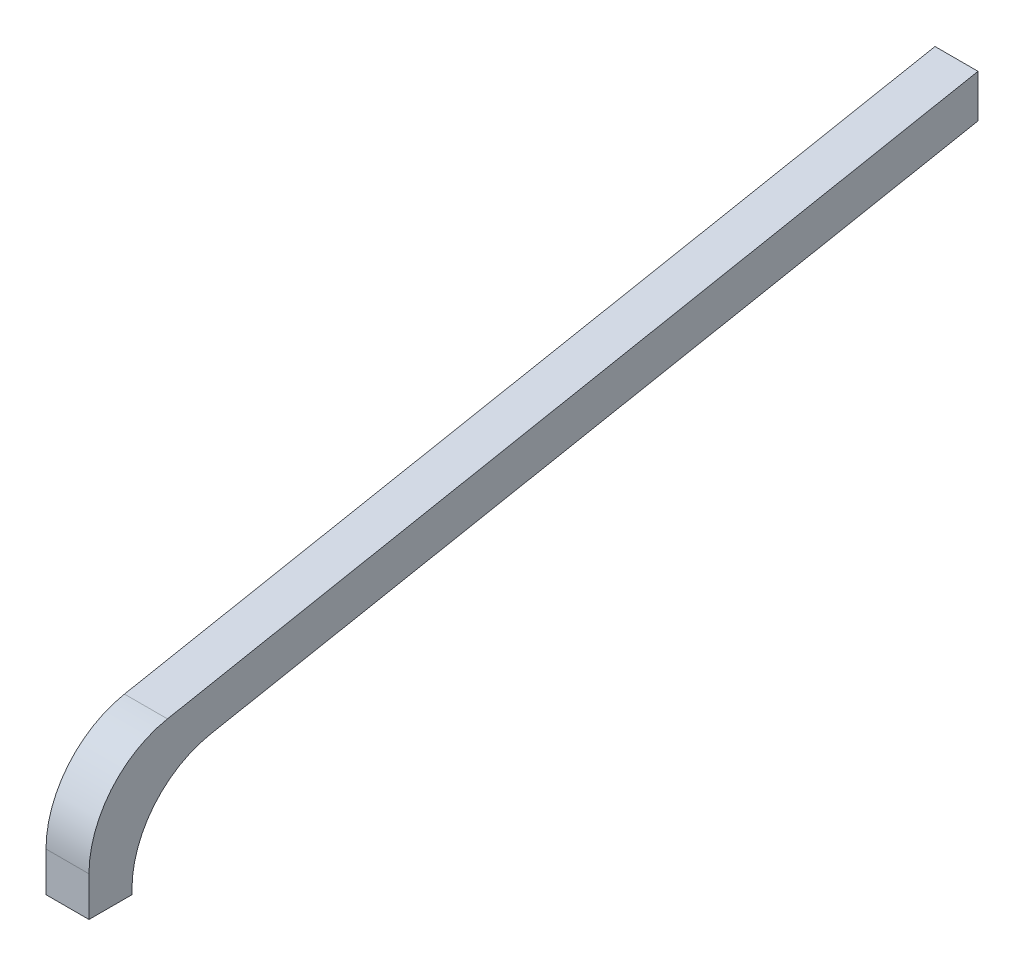
ISO-10303-21;
HEADER;
FILE_DESCRIPTION(('STEP AP214'),'2;1');
FILE_NAME('part.step','',(''),(''),'','','');
FILE_SCHEMA(('AUTOMOTIVE_DESIGN { 1 0 10303 214 1 1 1 1 }'));
ENDSEC;
DATA;
#1=APPLICATION_CONTEXT('core data for automotive mechanical design processes');
#2=APPLICATION_PROTOCOL_DEFINITION('international standard','automotive_design',2000,#1);
#3=PRODUCT_CONTEXT('',#1,'mechanical');
#4=PRODUCT('Part','Part','',(#3));
#5=PRODUCT_RELATED_PRODUCT_CATEGORY('part','',(#4));
#6=PRODUCT_DEFINITION_FORMATION('','',#4);
#7=PRODUCT_DEFINITION_CONTEXT('part definition',#1,'design');
#8=PRODUCT_DEFINITION('design','',#6,#7);
#9=PRODUCT_DEFINITION_SHAPE('','',#8);
#10=(LENGTH_UNIT() NAMED_UNIT(*) SI_UNIT(.MILLI.,.METRE.));
#11=(NAMED_UNIT(*) PLANE_ANGLE_UNIT() SI_UNIT($,.RADIAN.));
#12=(NAMED_UNIT(*) SI_UNIT($,.STERADIAN.) SOLID_ANGLE_UNIT());
#13=UNCERTAINTY_MEASURE_WITH_UNIT(LENGTH_MEASURE(1.E-05),#10,'distance_accuracy_value','');
#14=(GEOMETRIC_REPRESENTATION_CONTEXT(3) GLOBAL_UNCERTAINTY_ASSIGNED_CONTEXT((#13)) GLOBAL_UNIT_ASSIGNED_CONTEXT((#10,
#11,#12)) REPRESENTATION_CONTEXT('',''));
#15=CARTESIAN_POINT('',(0.,0.,0.));
#16=DIRECTION('',(0.,0.,1.));
#17=DIRECTION('',(1.,0.,0.));
#18=AXIS2_PLACEMENT_3D('',#15,#16,#17);
#19=CARTESIAN_POINT('',(1.30175,-3.01580115473571,-2.8055));
#20=DIRECTION('',(1.,0.,0.));
#21=DIRECTION('',(0.,0.,-1.));
#22=AXIS2_PLACEMENT_3D('',#19,#20,#21);
#23=PLANE('',#22);
#24=DIRECTION('',(0.,-0.18846469104419,0.982079966311104));
#25=VECTOR('',#24,1.);
#26=CARTESIAN_POINT('',(1.30175,-2.3929200336889,-3.06153530895581));
#27=LINE('',#26,#25);
#28=CARTESIAN_POINT('',(1.30175,-0.869500000000001,-11.));
#29=VERTEX_POINT('',#28);
#30=CARTESIAN_POINT('',(1.30175,-2.3929200336889,-3.06153530895581));
#31=VERTEX_POINT('',#30);
#32=EDGE_CURVE('E96',#29,#31,#27,.T.);
#33=ORIENTED_EDGE('',*,*,#32,.T.);
#34=CARTESIAN_POINT('',(1.30175,-3.375,-3.25));
#35=DIRECTION('',(-1.,0.,0.));
#36=DIRECTION('',(0.,0.,1.));
#37=AXIS2_PLACEMENT_3D('',#34,#35,#36);
#38=CIRCLE('',#37,1.);
#39=CARTESIAN_POINT('',(1.30175,-3.375,-2.25));
#40=VERTEX_POINT('',#39);
#41=EDGE_CURVE('E119',#31,#40,#38,.F.);
#42=ORIENTED_EDGE('',*,*,#41,.T.);
#43=DIRECTION('',(0.,1.,0.));
#44=VECTOR('',#43,1.);
#45=CARTESIAN_POINT('',(1.30175,-3.425,-2.25));
#46=LINE('',#45,#44);
#47=CARTESIAN_POINT('',(1.30175,-3.425,-2.25));
#48=VERTEX_POINT('',#47);
#49=EDGE_CURVE('E124',#40,#48,#46,.F.);
#50=ORIENTED_EDGE('',*,*,#49,.T.);
#51=DIRECTION('',(0.,0.,1.));
#52=VECTOR('',#51,1.);
#53=CARTESIAN_POINT('',(1.30175,-3.425,-1.8055));
#54=LINE('',#53,#52);
#55=CARTESIAN_POINT('',(1.30175,-3.425,-1.8055));
#56=VERTEX_POINT('',#55);
#57=EDGE_CURVE('E133',#48,#56,#54,.T.);
#58=ORIENTED_EDGE('',*,*,#57,.T.);
#59=DIRECTION('',(0.,1.,0.));
#60=VECTOR('',#59,1.);
#61=CARTESIAN_POINT('',(1.30175,-3.01580115473571,-1.8055));
#62=LINE('',#61,#60);
#63=CARTESIAN_POINT('',(1.30175,-3.01580115473571,-1.8055));
#64=VERTEX_POINT('',#63);
#65=EDGE_CURVE('E141',#56,#64,#62,.T.);
#66=ORIENTED_EDGE('',*,*,#65,.T.);
#67=CARTESIAN_POINT('',(1.30175,-3.01580115473571,-2.8055));
#68=DIRECTION('',(-1.,0.,0.));
#69=DIRECTION('',(0.,0.,1.));
#70=AXIS2_PLACEMENT_3D('',#67,#68,#69);
#71=CIRCLE('',#70,1.);
#72=CARTESIAN_POINT('',(1.30175,-2.03372118842461,-2.61703530895581));
#73=VERTEX_POINT('',#72);
#74=EDGE_CURVE('E20',#73,#64,#71,.F.);
#75=ORIENTED_EDGE('',*,*,#74,.F.);
#76=DIRECTION('',(0.,0.18846469104419,-0.982079966311104));
#77=VECTOR('',#76,1.);
#78=CARTESIAN_POINT('',(1.30175,-0.425000000000001,-11.));
#79=LINE('',#78,#77);
#80=CARTESIAN_POINT('',(1.30175,-0.425000000000001,-11.));
#81=VERTEX_POINT('',#80);
#82=EDGE_CURVE('E150',#73,#81,#79,.T.);
#83=ORIENTED_EDGE('',*,*,#82,.T.);
#84=DIRECTION('',(0.,1.,0.));
#85=VECTOR('',#84,1.);
#86=CARTESIAN_POINT('',(1.30175,-0.869500000000001,-11.));
#87=LINE('',#86,#85);
#88=EDGE_CURVE('E70',#81,#29,#87,.F.);
#89=ORIENTED_EDGE('',*,*,#88,.T.);
#90=EDGE_LOOP('',(#33,#42,#50,#58,#66,#75,#83,#89));
#91=FACE_BOUND('',#90,.T.);
#92=ADVANCED_FACE('F17',(#91),#23,.F.);
#93=CARTESIAN_POINT('',(1.74625,-0.869500000000001,-11.));
#94=DIRECTION('',(0.,0.,1.));
#95=DIRECTION('',(1.,0.,0.));
#96=AXIS2_PLACEMENT_3D('',#93,#94,#95);
#97=PLANE('',#96);
#98=DIRECTION('',(1.,0.,0.));
#99=VECTOR('',#98,1.);
#100=CARTESIAN_POINT('',(1.74625,-0.425000000000001,-11.));
#101=LINE('',#100,#99);
#102=CARTESIAN_POINT('',(1.74625,-0.425000000000001,-11.));
#103=VERTEX_POINT('',#102);
#104=EDGE_CURVE('E91',#81,#103,#101,.T.);
#105=ORIENTED_EDGE('',*,*,#104,.T.);
#106=DIRECTION('',(0.,1.,0.));
#107=VECTOR('',#106,1.);
#108=CARTESIAN_POINT('',(1.74625,-3.01580115473571,-11.));
#109=LINE('',#108,#107);
#110=CARTESIAN_POINT('',(1.74625,-0.869500000000001,-11.));
#111=VERTEX_POINT('',#110);
#112=EDGE_CURVE('E85',#111,#103,#109,.T.);
#113=ORIENTED_EDGE('',*,*,#112,.F.);
#114=DIRECTION('',(1.,0.,0.));
#115=VECTOR('',#114,1.);
#116=CARTESIAN_POINT('',(1.74625,-0.869500000000001,-11.));
#117=LINE('',#116,#115);
#118=EDGE_CURVE('E88',#111,#29,#117,.F.);
#119=ORIENTED_EDGE('',*,*,#118,.T.);
#120=ORIENTED_EDGE('',*,*,#88,.F.);
#121=EDGE_LOOP('',(#105,#113,#119,#120));
#122=FACE_BOUND('',#121,.T.);
#123=ADVANCED_FACE('F87',(#122),#97,.F.);
#124=CARTESIAN_POINT('',(1.74625,-0.425000000000001,-11.));
#125=DIRECTION('',(0.,-0.982079966311104,-0.18846469104419));
#126=DIRECTION('',(0.,0.18846469104419,-0.982079966311104));
#127=AXIS2_PLACEMENT_3D('',#124,#125,#126);
#128=PLANE('',#127);
#129=DIRECTION('',(-1.,0.,0.));
#130=VECTOR('',#129,1.);
#131=CARTESIAN_POINT('',(1.74625,-2.03372118842461,-2.61703530895581));
#132=LINE('',#131,#130);
#133=CARTESIAN_POINT('',(1.74625,-2.03372118842461,-2.61703530895581));
#134=VERTEX_POINT('',#133);
#135=EDGE_CURVE('E146',#134,#73,#132,.T.);
#136=ORIENTED_EDGE('',*,*,#135,.F.);
#137=DIRECTION('',(0.,-0.18846469104419,0.982079966311103));
#138=VECTOR('',#137,1.);
#139=CARTESIAN_POINT('',(1.74625,-0.425000000000001,-11.));
#140=LINE('',#139,#138);
#141=EDGE_CURVE('E95',#103,#134,#140,.T.);
#142=ORIENTED_EDGE('',*,*,#141,.F.);
#143=ORIENTED_EDGE('',*,*,#104,.F.);
#144=ORIENTED_EDGE('',*,*,#82,.F.);
#145=EDGE_LOOP('',(#136,#142,#143,#144));
#146=FACE_BOUND('',#145,.T.);
#147=ADVANCED_FACE('F190',(#146),#128,.F.);
#148=CARTESIAN_POINT('',(1.74625,-3.01580115473571,-2.8055));
#149=DIRECTION('',(-1.,0.,0.));
#150=DIRECTION('',(0.,0.,1.));
#151=AXIS2_PLACEMENT_3D('',#148,#149,#150);
#152=CYLINDRICAL_SURFACE('',#151,1.);
#153=CARTESIAN_POINT('',(1.74625,-3.01580115473571,-2.8055));
#154=DIRECTION('',(-1.,0.,0.));
#155=DIRECTION('',(0.,0.,1.));
#156=AXIS2_PLACEMENT_3D('',#153,#154,#155);
#157=CIRCLE('',#156,1.);
#158=CARTESIAN_POINT('',(1.74625,-3.01580115473571,-1.8055));
#159=VERTEX_POINT('',#158);
#160=EDGE_CURVE('E116',#134,#159,#157,.F.);
#161=ORIENTED_EDGE('',*,*,#160,.F.);
#162=ORIENTED_EDGE('',*,*,#135,.T.);
#163=ORIENTED_EDGE('',*,*,#74,.T.);
#164=DIRECTION('',(-1.,0.,0.));
#165=VECTOR('',#164,1.);
#166=CARTESIAN_POINT('',(1.74625,-3.01580115473571,-1.8055));
#167=LINE('',#166,#165);
#168=EDGE_CURVE('E144',#64,#159,#167,.F.);
#169=ORIENTED_EDGE('',*,*,#168,.T.);
#170=EDGE_LOOP('',(#161,#162,#163,#169));
#171=FACE_BOUND('',#170,.T.);
#172=ADVANCED_FACE('F169',(#171),#152,.T.);
#173=CARTESIAN_POINT('',(1.74625,-3.01580115473571,-1.8055));
#174=DIRECTION('',(0.,0.,-1.));
#175=DIRECTION('',(-1.,0.,0.));
#176=AXIS2_PLACEMENT_3D('',#173,#174,#175);
#177=PLANE('',#176);
#178=DIRECTION('',(1.,0.,0.));
#179=VECTOR('',#178,1.);
#180=CARTESIAN_POINT('',(1.74625,-3.425,-1.8055));
#181=LINE('',#180,#179);
#182=CARTESIAN_POINT('',(1.74625,-3.425,-1.8055));
#183=VERTEX_POINT('',#182);
#184=EDGE_CURVE('E139',#56,#183,#181,.T.);
#185=ORIENTED_EDGE('',*,*,#184,.T.);
#186=DIRECTION('',(0.,1.,0.));
#187=VECTOR('',#186,1.);
#188=CARTESIAN_POINT('',(1.74625,-3.01580115473571,-1.8055));
#189=LINE('',#188,#187);
#190=EDGE_CURVE('E118',#159,#183,#189,.F.);
#191=ORIENTED_EDGE('',*,*,#190,.F.);
#192=ORIENTED_EDGE('',*,*,#168,.F.);
#193=ORIENTED_EDGE('',*,*,#65,.F.);
#194=EDGE_LOOP('',(#185,#191,#192,#193));
#195=FACE_BOUND('',#194,.T.);
#196=ADVANCED_FACE('F174',(#195),#177,.F.);
#197=CARTESIAN_POINT('',(1.74625,-3.425,-1.8055));
#198=DIRECTION('',(0.,1.,0.));
#199=DIRECTION('',(0.,0.,1.));
#200=AXIS2_PLACEMENT_3D('',#197,#198,#199);
#201=PLANE('',#200);
#202=DIRECTION('',(1.,0.,0.));
#203=VECTOR('',#202,1.);
#204=CARTESIAN_POINT('',(1.74625,-3.425,-2.25));
#205=LINE('',#204,#203);
#206=CARTESIAN_POINT('',(1.74625,-3.425,-2.25));
#207=VERTEX_POINT('',#206);
#208=EDGE_CURVE('E127',#48,#207,#205,.T.);
#209=ORIENTED_EDGE('',*,*,#208,.T.);
#210=DIRECTION('',(0.,0.,-1.));
#211=VECTOR('',#210,1.);
#212=CARTESIAN_POINT('',(1.74625,-3.425,-2.8055));
#213=LINE('',#212,#211);
#214=EDGE_CURVE('E110',#183,#207,#213,.T.);
#215=ORIENTED_EDGE('',*,*,#214,.F.);
#216=ORIENTED_EDGE('',*,*,#184,.F.);
#217=ORIENTED_EDGE('',*,*,#57,.F.);
#218=EDGE_LOOP('',(#209,#215,#216,#217));
#219=FACE_BOUND('',#218,.T.);
#220=ADVANCED_FACE('F212',(#219),#201,.F.);
#221=CARTESIAN_POINT('',(1.74625,-3.425,-2.25));
#222=DIRECTION('',(0.,0.,1.));
#223=DIRECTION('',(1.,0.,0.));
#224=AXIS2_PLACEMENT_3D('',#221,#222,#223);
#225=PLANE('',#224);
#226=DIRECTION('',(-1.,0.,0.));
#227=VECTOR('',#226,1.);
#228=CARTESIAN_POINT('',(1.74625,-3.375,-2.25));
#229=LINE('',#228,#227);
#230=CARTESIAN_POINT('',(1.74625,-3.375,-2.25));
#231=VERTEX_POINT('',#230);
#232=EDGE_CURVE('E121',#40,#231,#229,.F.);
#233=ORIENTED_EDGE('',*,*,#232,.T.);
#234=DIRECTION('',(0.,1.,0.));
#235=VECTOR('',#234,1.);
#236=CARTESIAN_POINT('',(1.74625,-3.01580115473571,-2.25));
#237=LINE('',#236,#235);
#238=EDGE_CURVE('E107',#207,#231,#237,.T.);
#239=ORIENTED_EDGE('',*,*,#238,.F.);
#240=ORIENTED_EDGE('',*,*,#208,.F.);
#241=ORIENTED_EDGE('',*,*,#49,.F.);
#242=EDGE_LOOP('',(#233,#239,#240,#241));
#243=FACE_BOUND('',#242,.T.);
#244=ADVANCED_FACE('F209',(#243),#225,.F.);
#245=CARTESIAN_POINT('',(1.74625,-3.375,-3.25));
#246=DIRECTION('',(-1.,0.,0.));
#247=DIRECTION('',(0.,0.,1.));
#248=AXIS2_PLACEMENT_3D('',#245,#246,#247);
#249=CYLINDRICAL_SURFACE('',#248,1.);
#250=DIRECTION('',(1.,0.,0.));
#251=VECTOR('',#250,1.);
#252=CARTESIAN_POINT('',(1.74625,-2.3929200336889,-3.06153530895581));
#253=LINE('',#252,#251);
#254=CARTESIAN_POINT('',(1.74625,-2.3929200336889,-3.06153530895581));
#255=VERTEX_POINT('',#254);
#256=EDGE_CURVE('E35',#31,#255,#253,.T.);
#257=ORIENTED_EDGE('',*,*,#256,.T.);
#258=CARTESIAN_POINT('',(1.74625,-3.375,-3.25));
#259=DIRECTION('',(-1.,0.,0.));
#260=DIRECTION('',(0.,0.,1.));
#261=AXIS2_PLACEMENT_3D('',#258,#259,#260);
#262=CIRCLE('',#261,1.);
#263=EDGE_CURVE('E26',#231,#255,#262,.T.);
#264=ORIENTED_EDGE('',*,*,#263,.F.);
#265=ORIENTED_EDGE('',*,*,#232,.F.);
#266=ORIENTED_EDGE('',*,*,#41,.F.);
#267=EDGE_LOOP('',(#257,#264,#265,#266));
#268=FACE_BOUND('',#267,.T.);
#269=ADVANCED_FACE('F204',(#268),#249,.F.);
#270=CARTESIAN_POINT('',(1.74625,-2.3929200336889,-3.06153530895581));
#271=DIRECTION('',(0.,0.982079966311104,0.18846469104419));
#272=DIRECTION('',(0.,-0.18846469104419,0.982079966311104));
#273=AXIS2_PLACEMENT_3D('',#270,#271,#272);
#274=PLANE('',#273);
#275=ORIENTED_EDGE('',*,*,#118,.F.);
#276=DIRECTION('',(0.,0.18846469104419,-0.982079966311103));
#277=VECTOR('',#276,1.);
#278=CARTESIAN_POINT('',(1.74625,-2.3929200336889,-3.06153530895581));
#279=LINE('',#278,#277);
#280=EDGE_CURVE('E11',#255,#111,#279,.T.);
#281=ORIENTED_EDGE('',*,*,#280,.F.);
#282=ORIENTED_EDGE('',*,*,#256,.F.);
#283=ORIENTED_EDGE('',*,*,#32,.F.);
#284=EDGE_LOOP('',(#275,#281,#282,#283));
#285=FACE_BOUND('',#284,.T.);
#286=ADVANCED_FACE('F99',(#285),#274,.F.);
#287=CARTESIAN_POINT('',(1.74625,-3.01580115473571,-2.8055));
#288=DIRECTION('',(1.,0.,0.));
#289=DIRECTION('',(0.,0.,-1.));
#290=AXIS2_PLACEMENT_3D('',#287,#288,#289);
#291=PLANE('',#290);
#292=ORIENTED_EDGE('',*,*,#263,.T.);
#293=ORIENTED_EDGE('',*,*,#280,.T.);
#294=ORIENTED_EDGE('',*,*,#112,.T.);
#295=ORIENTED_EDGE('',*,*,#141,.T.);
#296=ORIENTED_EDGE('',*,*,#160,.T.);
#297=ORIENTED_EDGE('',*,*,#190,.T.);
#298=ORIENTED_EDGE('',*,*,#214,.T.);
#299=ORIENTED_EDGE('',*,*,#238,.T.);
#300=EDGE_LOOP('',(#292,#293,#294,#295,#296,#297,#298,#299));
#301=FACE_BOUND('',#300,.T.);
#302=ADVANCED_FACE('F103',(#301),#291,.T.);
#303=CLOSED_SHELL('',(#92,#123,#147,#172,#196,#220,#244,#269,#286,#302));
#304=MANIFOLD_SOLID_BREP('B1',#303);
#305=ADVANCED_BREP_SHAPE_REPRESENTATION('',(#18,#304),#14);
#306=SHAPE_DEFINITION_REPRESENTATION(#9,#305);
ENDSEC;
END-ISO-10303-21;
